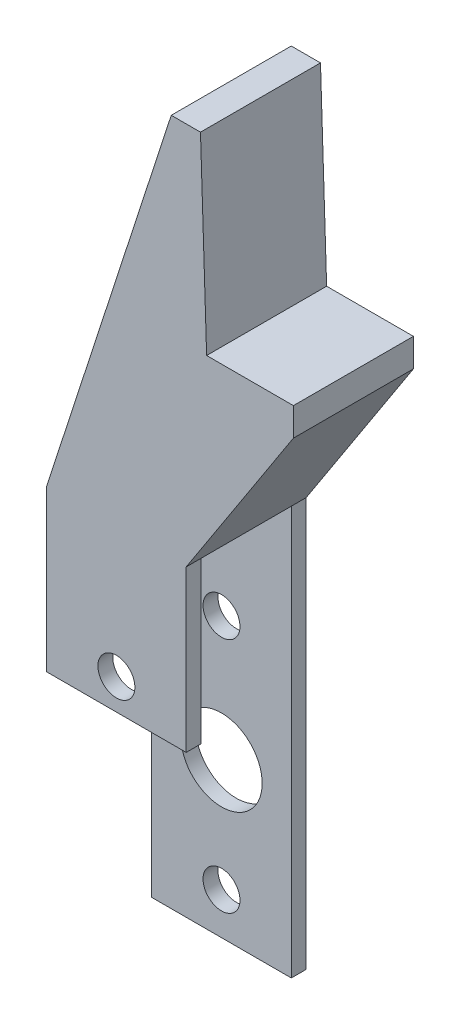
ISO-10303-21;
HEADER;
FILE_DESCRIPTION(('STEP AP214'),'2;1');
FILE_NAME('part.step','',(''),(''),'','','');
FILE_SCHEMA(('AUTOMOTIVE_DESIGN { 1 0 10303 214 1 1 1 1 }'));
ENDSEC;
DATA;
#1=APPLICATION_CONTEXT('core data for automotive mechanical design processes');
#2=APPLICATION_PROTOCOL_DEFINITION('international standard','automotive_design',2000,#1);
#3=PRODUCT_CONTEXT('',#1,'mechanical');
#4=PRODUCT('Part','Part','',(#3));
#5=PRODUCT_RELATED_PRODUCT_CATEGORY('part','',(#4));
#6=PRODUCT_DEFINITION_FORMATION('','',#4);
#7=PRODUCT_DEFINITION_CONTEXT('part definition',#1,'design');
#8=PRODUCT_DEFINITION('design','',#6,#7);
#9=PRODUCT_DEFINITION_SHAPE('','',#8);
#10=(LENGTH_UNIT() NAMED_UNIT(*) SI_UNIT(.MILLI.,.METRE.));
#11=(NAMED_UNIT(*) PLANE_ANGLE_UNIT() SI_UNIT($,.RADIAN.));
#12=(NAMED_UNIT(*) SI_UNIT($,.STERADIAN.) SOLID_ANGLE_UNIT());
#13=UNCERTAINTY_MEASURE_WITH_UNIT(LENGTH_MEASURE(1.E-05),#10,'distance_accuracy_value','');
#14=(GEOMETRIC_REPRESENTATION_CONTEXT(3) GLOBAL_UNCERTAINTY_ASSIGNED_CONTEXT((#13)) GLOBAL_UNIT_ASSIGNED_CONTEXT((#10,
#11,#12)) REPRESENTATION_CONTEXT('',''));
#15=CARTESIAN_POINT('',(0.,0.,0.));
#16=DIRECTION('',(0.,0.,1.));
#17=DIRECTION('',(1.,0.,0.));
#18=AXIS2_PLACEMENT_3D('',#15,#16,#17);
#19=CARTESIAN_POINT('',(-110.514643089675,1.26241017740988,12.2936));
#20=DIRECTION('',(1.,0.,0.));
#21=DIRECTION('',(0.,0.,-1.));
#22=AXIS2_PLACEMENT_3D('',#19,#20,#21);
#23=PLANE('',#22);
#24=DIRECTION('',(0.,0.,-1.));
#25=VECTOR('',#24,1.);
#26=CARTESIAN_POINT('',(-110.514643089675,1.26241017740988,12.2936));
#27=LINE('',#26,#25);
#28=CARTESIAN_POINT('',(-110.514643089675,1.26241017740989,1.524));
#29=VERTEX_POINT('',#28);
#30=CARTESIAN_POINT('',(-110.514643089675,1.26241017740988,0.));
#31=VERTEX_POINT('',#30);
#32=EDGE_CURVE('E11',#29,#31,#27,.T.);
#33=ORIENTED_EDGE('',*,*,#32,.F.);
#34=DIRECTION('',(0.,1.,0.));
#35=VECTOR('',#34,1.);
#36=CARTESIAN_POINT('',(-110.514643089675,0.,1.524));
#37=LINE('',#36,#35);
#38=CARTESIAN_POINT('',(-110.514643089675,43.1216101774099,1.524));
#39=VERTEX_POINT('',#38);
#40=EDGE_CURVE('E213',#29,#39,#37,.T.);
#41=ORIENTED_EDGE('',*,*,#40,.T.);
#42=DIRECTION('',(0.,0.,-1.));
#43=VECTOR('',#42,1.);
#44=CARTESIAN_POINT('',(-110.514643089675,43.1216101774099,12.2936));
#45=LINE('',#44,#43);
#46=CARTESIAN_POINT('',(-110.514643089675,43.1216101774099,0.));
#47=VERTEX_POINT('',#46);
#48=EDGE_CURVE('E95',#39,#47,#45,.T.);
#49=ORIENTED_EDGE('',*,*,#48,.T.);
#50=DIRECTION('',(0.,-1.,0.));
#51=VECTOR('',#50,1.);
#52=CARTESIAN_POINT('',(-110.514643089675,1.26241017740988,0.));
#53=LINE('',#52,#51);
#54=EDGE_CURVE('E144',#47,#31,#53,.T.);
#55=ORIENTED_EDGE('',*,*,#54,.T.);
#56=EDGE_LOOP('',(#33,#41,#49,#55));
#57=FACE_BOUND('',#56,.T.);
#58=ADVANCED_FACE('F33',(#57),#23,.F.);
#59=CARTESIAN_POINT('',(-96.2144430896747,1.26241017740988,12.2936));
#60=DIRECTION('',(-1.,0.,0.));
#61=DIRECTION('',(0.,-1.,0.));
#62=AXIS2_PLACEMENT_3D('',#59,#60,#61);
#63=PLANE('',#62);
#64=DIRECTION('',(0.,0.,-1.));
#65=VECTOR('',#64,1.);
#66=CARTESIAN_POINT('',(-96.2144430896746,43.1216101774099,12.2936));
#67=LINE('',#66,#65);
#68=CARTESIAN_POINT('',(-96.2144430896746,43.1216101774099,1.524));
#69=VERTEX_POINT('',#68);
#70=CARTESIAN_POINT('',(-96.2144430896746,43.1216101774099,0.));
#71=VERTEX_POINT('',#70);
#72=EDGE_CURVE('E176',#69,#71,#67,.T.);
#73=ORIENTED_EDGE('',*,*,#72,.F.);
#74=DIRECTION('',(0.,1.,0.));
#75=VECTOR('',#74,1.);
#76=CARTESIAN_POINT('',(-96.2144430896747,0.,1.524));
#77=LINE('',#76,#75);
#78=CARTESIAN_POINT('',(-96.2144430896747,1.26241017740988,1.524));
#79=VERTEX_POINT('',#78);
#80=EDGE_CURVE('E222',#79,#69,#77,.T.);
#81=ORIENTED_EDGE('',*,*,#80,.F.);
#82=DIRECTION('',(0.,0.,-1.));
#83=VECTOR('',#82,1.);
#84=CARTESIAN_POINT('',(-96.2144430896747,1.26241017740988,12.2936));
#85=LINE('',#84,#83);
#86=CARTESIAN_POINT('',(-96.2144430896747,1.26241017740988,0.));
#87=VERTEX_POINT('',#86);
#88=EDGE_CURVE('E42',#79,#87,#85,.T.);
#89=ORIENTED_EDGE('',*,*,#88,.T.);
#90=DIRECTION('',(0.,1.,0.));
#91=VECTOR('',#90,1.);
#92=CARTESIAN_POINT('',(-96.2144430896747,1.26241017740988,0.));
#93=LINE('',#92,#91);
#94=EDGE_CURVE('E150',#87,#71,#93,.T.);
#95=ORIENTED_EDGE('',*,*,#94,.T.);
#96=EDGE_LOOP('',(#73,#81,#89,#95));
#97=FACE_BOUND('',#96,.T.);
#98=ADVANCED_FACE('F297',(#97),#63,.F.);
#99=CARTESIAN_POINT('',(-110.514643089675,43.1216101774099,12.2936));
#100=VERTEX_POINT('',#99);
#101=CARTESIAN_POINT('',(-110.514643089675,43.1216101774099,10.7696));
#102=VERTEX_POINT('',#101);
#103=EDGE_CURVE('E165',#100,#102,#45,.T.);
#104=ORIENTED_EDGE('',*,*,#103,.T.);
#105=DIRECTION('',(0.,-1.,0.));
#106=VECTOR('',#105,1.);
#107=CARTESIAN_POINT('',(-110.514643089675,0.,10.7696));
#108=LINE('',#107,#106);
#109=CARTESIAN_POINT('',(-110.514643089675,26.6624101774099,10.7696));
#110=VERTEX_POINT('',#109);
#111=EDGE_CURVE('E206',#102,#110,#108,.T.);
#112=ORIENTED_EDGE('',*,*,#111,.T.);
#113=DIRECTION('',(0.,0.,1.));
#114=VECTOR('',#113,1.);
#115=CARTESIAN_POINT('',(-110.514643089675,26.6624101774099,0.));
#116=LINE('',#115,#114);
#117=CARTESIAN_POINT('',(-110.514643089675,26.6624101774099,12.2936));
#118=VERTEX_POINT('',#117);
#119=EDGE_CURVE('E209',#110,#118,#116,.T.);
#120=ORIENTED_EDGE('',*,*,#119,.T.);
#121=DIRECTION('',(0.,-1.,0.));
#122=VECTOR('',#121,1.);
#123=CARTESIAN_POINT('',(-110.514643089675,1.26241017740988,12.2936));
#124=LINE('',#123,#122);
#125=EDGE_CURVE('E164',#100,#118,#124,.T.);
#126=ORIENTED_EDGE('',*,*,#125,.F.);
#127=EDGE_LOOP('',(#104,#112,#120,#126));
#128=FACE_BOUND('',#127,.T.);
#129=ADVANCED_FACE('F35',(#128),#23,.F.);
#130=CARTESIAN_POINT('',(-110.514643089675,1.26241017740988,12.2936));
#131=DIRECTION('',(0.,1.,0.));
#132=DIRECTION('',(0.,0.,1.));
#133=AXIS2_PLACEMENT_3D('',#130,#131,#132);
#134=PLANE('',#133);
#135=ORIENTED_EDGE('',*,*,#88,.F.);
#136=DIRECTION('',(1.,0.,0.));
#137=VECTOR('',#136,1.);
#138=CARTESIAN_POINT('',(-110.514643089675,1.26241017740989,1.524));
#139=LINE('',#138,#137);
#140=EDGE_CURVE('E232',#29,#79,#139,.T.);
#141=ORIENTED_EDGE('',*,*,#140,.F.);
#142=ORIENTED_EDGE('',*,*,#32,.T.);
#143=DIRECTION('',(1.,0.,0.));
#144=VECTOR('',#143,1.);
#145=CARTESIAN_POINT('',(-110.514643089675,1.26241017740988,0.));
#146=LINE('',#145,#144);
#147=EDGE_CURVE('E146',#31,#87,#146,.T.);
#148=ORIENTED_EDGE('',*,*,#147,.T.);
#149=EDGE_LOOP('',(#135,#141,#142,#148));
#150=FACE_BOUND('',#149,.T.);
#151=ADVANCED_FACE('F302',(#150),#134,.F.);
#152=DIRECTION('',(0.,0.,1.));
#153=VECTOR('',#152,1.);
#154=CARTESIAN_POINT('',(-96.2144430896746,26.6624101774099,0.));
#155=LINE('',#154,#153);
#156=CARTESIAN_POINT('',(-96.2144430896746,26.6624101774099,10.7696));
#157=VERTEX_POINT('',#156);
#158=CARTESIAN_POINT('',(-96.2144430896746,26.6624101774099,12.2936));
#159=VERTEX_POINT('',#158);
#160=EDGE_CURVE('E50',#157,#159,#155,.T.);
#161=ORIENTED_EDGE('',*,*,#160,.F.);
#162=DIRECTION('',(0.,-1.,0.));
#163=VECTOR('',#162,1.);
#164=CARTESIAN_POINT('',(-96.2144430896747,0.,10.7696));
#165=LINE('',#164,#163);
#166=CARTESIAN_POINT('',(-96.2144430896746,43.1216101774099,10.7696));
#167=VERTEX_POINT('',#166);
#168=EDGE_CURVE('E183',#167,#157,#165,.T.);
#169=ORIENTED_EDGE('',*,*,#168,.F.);
#170=CARTESIAN_POINT('',(-96.2144430896746,43.1216101774099,12.2936));
#171=VERTEX_POINT('',#170);
#172=EDGE_CURVE('E177',#171,#167,#67,.T.);
#173=ORIENTED_EDGE('',*,*,#172,.F.);
#174=DIRECTION('',(0.,1.,0.));
#175=VECTOR('',#174,1.);
#176=CARTESIAN_POINT('',(-96.2144430896747,1.26241017740988,12.2936));
#177=LINE('',#176,#175);
#178=EDGE_CURVE('E102',#159,#171,#177,.T.);
#179=ORIENTED_EDGE('',*,*,#178,.F.);
#180=EDGE_LOOP('',(#161,#169,#173,#179));
#181=FACE_BOUND('',#180,.T.);
#182=ADVANCED_FACE('F290',(#181),#63,.F.);
#183=CARTESIAN_POINT('',(-96.2144430896746,43.1216101774099,12.2936));
#184=DIRECTION('',(-0.838670567945426,0.544639035015025,0.));
#185=DIRECTION('',(-0.544639035015025,-0.838670567945426,0.));
#186=AXIS2_PLACEMENT_3D('',#183,#184,#185);
#187=PLANE('',#186);
#188=DIRECTION('',(0.544639035015025,0.838670567945426,0.));
#189=VECTOR('',#188,1.);
#190=CARTESIAN_POINT('',(-96.2144430896746,43.1216101774099,0.));
#191=LINE('',#190,#189);
#192=CARTESIAN_POINT('',(-85.2303808871056,60.0355827235061,0.));
#193=VERTEX_POINT('',#192);
#194=EDGE_CURVE('E153',#71,#193,#191,.T.);
#195=ORIENTED_EDGE('',*,*,#194,.T.);
#196=DIRECTION('',(0.,0.,-1.));
#197=VECTOR('',#196,1.);
#198=CARTESIAN_POINT('',(-85.2303808871056,60.0355827235061,12.2936));
#199=LINE('',#198,#197);
#200=CARTESIAN_POINT('',(-85.2303808871056,60.0355827235061,12.2936));
#201=VERTEX_POINT('',#200);
#202=EDGE_CURVE('E173',#201,#193,#199,.T.);
#203=ORIENTED_EDGE('',*,*,#202,.F.);
#204=DIRECTION('',(0.544639035015025,0.838670567945426,0.));
#205=VECTOR('',#204,1.);
#206=CARTESIAN_POINT('',(-96.2144430896746,43.1216101774099,12.2936));
#207=LINE('',#206,#205);
#208=EDGE_CURVE('E240',#171,#201,#207,.T.);
#209=ORIENTED_EDGE('',*,*,#208,.F.);
#210=ORIENTED_EDGE('',*,*,#172,.T.);
#211=DIRECTION('',(0.,0.,1.));
#212=VECTOR('',#211,1.);
#213=CARTESIAN_POINT('',(-96.2144430896746,43.1216101774099,0.));
#214=LINE('',#213,#212);
#215=EDGE_CURVE('E210',#69,#167,#214,.T.);
#216=ORIENTED_EDGE('',*,*,#215,.F.);
#217=ORIENTED_EDGE('',*,*,#72,.T.);
#218=EDGE_LOOP('',(#195,#203,#209,#210,#216,#217));
#219=FACE_BOUND('',#218,.T.);
#220=ADVANCED_FACE('F291',(#219),#187,.F.);
#221=CARTESIAN_POINT('',(-85.2303808871056,62.9240263733276,12.2936));
#222=DIRECTION('',(-1.,0.,0.));
#223=DIRECTION('',(0.,0.,1.));
#224=AXIS2_PLACEMENT_3D('',#221,#222,#223);
#225=PLANE('',#224);
#226=DIRECTION('',(0.,1.,0.));
#227=VECTOR('',#226,1.);
#228=CARTESIAN_POINT('',(-85.2303808871056,62.9240263733276,0.));
#229=LINE('',#228,#227);
#230=CARTESIAN_POINT('',(-85.2303808871056,62.9240263733276,0.));
#231=VERTEX_POINT('',#230);
#232=EDGE_CURVE('E155',#193,#231,#229,.T.);
#233=ORIENTED_EDGE('',*,*,#232,.T.);
#234=DIRECTION('',(0.,0.,-1.));
#235=VECTOR('',#234,1.);
#236=CARTESIAN_POINT('',(-85.2303808871056,62.9240263733276,12.2936));
#237=LINE('',#236,#235);
#238=CARTESIAN_POINT('',(-85.2303808871056,62.9240263733276,12.2936));
#239=VERTEX_POINT('',#238);
#240=EDGE_CURVE('E170',#239,#231,#237,.T.);
#241=ORIENTED_EDGE('',*,*,#240,.F.);
#242=DIRECTION('',(0.,1.,0.));
#243=VECTOR('',#242,1.);
#244=CARTESIAN_POINT('',(-85.2303808871056,62.9240263733276,12.2936));
#245=LINE('',#244,#243);
#246=EDGE_CURVE('E242',#201,#239,#245,.T.);
#247=ORIENTED_EDGE('',*,*,#246,.F.);
#248=ORIENTED_EDGE('',*,*,#202,.T.);
#249=EDGE_LOOP('',(#233,#241,#247,#248));
#250=FACE_BOUND('',#249,.T.);
#251=ADVANCED_FACE('F248',(#250),#225,.F.);
#252=CARTESIAN_POINT('',(-94.1200963562197,62.9240263733276,12.2936));
#253=DIRECTION('',(0.,-1.,0.));
#254=DIRECTION('',(0.,0.,-1.));
#255=AXIS2_PLACEMENT_3D('',#252,#253,#254);
#256=PLANE('',#255);
#257=DIRECTION('',(-1.,0.,0.));
#258=VECTOR('',#257,1.);
#259=CARTESIAN_POINT('',(-94.1200963562197,62.9240263733276,0.));
#260=LINE('',#259,#258);
#261=CARTESIAN_POINT('',(-94.1200963562197,62.9240263733276,0.));
#262=VERTEX_POINT('',#261);
#263=EDGE_CURVE('E157',#231,#262,#260,.T.);
#264=ORIENTED_EDGE('',*,*,#263,.T.);
#265=DIRECTION('',(0.,0.,-1.));
#266=VECTOR('',#265,1.);
#267=CARTESIAN_POINT('',(-94.1200963562197,62.9240263733276,12.2936));
#268=LINE('',#267,#266);
#269=CARTESIAN_POINT('',(-94.1200963562197,62.9240263733276,12.2936));
#270=VERTEX_POINT('',#269);
#271=EDGE_CURVE('E135',#270,#262,#268,.T.);
#272=ORIENTED_EDGE('',*,*,#271,.F.);
#273=DIRECTION('',(-1.,0.,0.));
#274=VECTOR('',#273,1.);
#275=CARTESIAN_POINT('',(-94.1200963562197,62.9240263733276,12.2936));
#276=LINE('',#275,#274);
#277=EDGE_CURVE('E123',#239,#270,#276,.T.);
#278=ORIENTED_EDGE('',*,*,#277,.F.);
#279=ORIENTED_EDGE('',*,*,#240,.T.);
#280=EDGE_LOOP('',(#264,#272,#278,#279));
#281=FACE_BOUND('',#280,.T.);
#282=ADVANCED_FACE('F252',(#281),#256,.F.);
#283=CARTESIAN_POINT('',(-94.1200963562197,62.9240263733276,12.2936));
#284=DIRECTION('',(-0.999478768727025,-0.0322829810257777,0.));
#285=DIRECTION('',(0.0322829810257777,-0.999478768727025,0.));
#286=AXIS2_PLACEMENT_3D('',#283,#284,#285);
#287=PLANE('',#286);
#288=DIRECTION('',(-0.0322829810257777,0.999478768727025,0.));
#289=VECTOR('',#288,1.);
#290=CARTESIAN_POINT('',(-94.1200963562197,62.9240263733276,0.));
#291=LINE('',#290,#289);
#292=CARTESIAN_POINT('',(-94.7499671742199,82.4247815585202,0.));
#293=VERTEX_POINT('',#292);
#294=EDGE_CURVE('E132',#262,#293,#291,.T.);
#295=ORIENTED_EDGE('',*,*,#294,.T.);
#296=DIRECTION('',(0.,0.,-1.));
#297=VECTOR('',#296,1.);
#298=CARTESIAN_POINT('',(-94.7499671742199,82.4247815585202,12.2936));
#299=LINE('',#298,#297);
#300=CARTESIAN_POINT('',(-94.7499671742199,82.4247815585202,12.2936));
#301=VERTEX_POINT('',#300);
#302=EDGE_CURVE('E129',#301,#293,#299,.T.);
#303=ORIENTED_EDGE('',*,*,#302,.F.);
#304=DIRECTION('',(-0.0322829810257777,0.999478768727025,0.));
#305=VECTOR('',#304,1.);
#306=CARTESIAN_POINT('',(-94.1200963562197,62.9240263733276,12.2936));
#307=LINE('',#306,#305);
#308=EDGE_CURVE('E116',#270,#301,#307,.T.);
#309=ORIENTED_EDGE('',*,*,#308,.F.);
#310=ORIENTED_EDGE('',*,*,#271,.T.);
#311=EDGE_LOOP('',(#295,#303,#309,#310));
#312=FACE_BOUND('',#311,.T.);
#313=ADVANCED_FACE('F130',(#312),#287,.F.);
#314=CARTESIAN_POINT('',(-94.7499671742199,82.4247815585202,12.2936));
#315=DIRECTION('',(0.,-1.,0.));
#316=DIRECTION('',(0.,0.,-1.));
#317=AXIS2_PLACEMENT_3D('',#314,#315,#316);
#318=PLANE('',#317);
#319=DIRECTION('',(-1.,0.,0.));
#320=VECTOR('',#319,1.);
#321=CARTESIAN_POINT('',(-94.7499671742199,82.4247815585202,0.));
#322=LINE('',#321,#320);
#323=CARTESIAN_POINT('',(-97.7442685835346,82.4247815585202,0.));
#324=VERTEX_POINT('',#323);
#325=EDGE_CURVE('E160',#293,#324,#322,.T.);
#326=ORIENTED_EDGE('',*,*,#325,.T.);
#327=DIRECTION('',(0.,0.,-1.));
#328=VECTOR('',#327,1.);
#329=CARTESIAN_POINT('',(-97.7442685835346,82.4247815585202,12.2936));
#330=LINE('',#329,#328);
#331=CARTESIAN_POINT('',(-97.7442685835346,82.4247815585202,12.2936));
#332=VERTEX_POINT('',#331);
#333=EDGE_CURVE('E136',#332,#324,#330,.T.);
#334=ORIENTED_EDGE('',*,*,#333,.F.);
#335=DIRECTION('',(-1.,0.,0.));
#336=VECTOR('',#335,1.);
#337=CARTESIAN_POINT('',(-94.7499671742199,82.4247815585202,12.2936));
#338=LINE('',#337,#336);
#339=EDGE_CURVE('E120',#301,#332,#338,.T.);
#340=ORIENTED_EDGE('',*,*,#339,.F.);
#341=ORIENTED_EDGE('',*,*,#302,.T.);
#342=EDGE_LOOP('',(#326,#334,#340,#341));
#343=FACE_BOUND('',#342,.T.);
#344=ADVANCED_FACE('F138',(#343),#318,.F.);
#345=CARTESIAN_POINT('',(-110.514643089675,43.1216101774099,12.2936));
#346=DIRECTION('',(0.951056516295154,-0.309016994374945,0.));
#347=DIRECTION('',(0.309016994374945,0.951056516295155,0.));
#348=AXIS2_PLACEMENT_3D('',#345,#346,#347);
#349=PLANE('',#348);
#350=DIRECTION('',(-0.309016994374945,-0.951056516295154,0.));
#351=VECTOR('',#350,1.);
#352=CARTESIAN_POINT('',(-110.514643089675,43.1216101774099,0.));
#353=LINE('',#352,#351);
#354=EDGE_CURVE('E162',#324,#47,#353,.T.);
#355=ORIENTED_EDGE('',*,*,#354,.T.);
#356=ORIENTED_EDGE('',*,*,#48,.F.);
#357=DIRECTION('',(0.,0.,1.));
#358=VECTOR('',#357,1.);
#359=CARTESIAN_POINT('',(-110.514643089675,43.1216101774099,0.));
#360=LINE('',#359,#358);
#361=EDGE_CURVE('E215',#39,#102,#360,.T.);
#362=ORIENTED_EDGE('',*,*,#361,.T.);
#363=ORIENTED_EDGE('',*,*,#103,.F.);
#364=DIRECTION('',(-0.309016994374945,-0.951056516295154,0.));
#365=VECTOR('',#364,1.);
#366=CARTESIAN_POINT('',(-110.514643089675,43.1216101774099,12.2936));
#367=LINE('',#366,#365);
#368=EDGE_CURVE('E59',#332,#100,#367,.T.);
#369=ORIENTED_EDGE('',*,*,#368,.F.);
#370=ORIENTED_EDGE('',*,*,#333,.T.);
#371=EDGE_LOOP('',(#355,#356,#362,#363,#369,#370));
#372=FACE_BOUND('',#371,.T.);
#373=ADVANCED_FACE('F258',(#372),#349,.F.);
#374=CARTESIAN_POINT('',(0.,0.,12.2936));
#375=DIRECTION('',(0.,0.,1.));
#376=DIRECTION('',(1.,0.,0.));
#377=AXIS2_PLACEMENT_3D('',#374,#375,#376);
#378=PLANE('',#377);
#379=CARTESIAN_POINT('',(-103.364543089675,29.8120101774099,12.2936));
#380=DIRECTION('',(0.,0.,1.));
#381=DIRECTION('',(1.,0.,0.));
#382=AXIS2_PLACEMENT_3D('',#379,#380,#381);
#383=CIRCLE('',#382,1.89230000000001);
#384=CARTESIAN_POINT('',(-101.472243089675,29.8120101774099,12.2936));
#385=VERTEX_POINT('',#384);
#386=EDGE_CURVE('E192',#385,#385,#383,.T.);
#387=ORIENTED_EDGE('',*,*,#386,.F.);
#388=EDGE_LOOP('',(#387));
#389=FACE_BOUND('',#388,.T.);
#390=DIRECTION('',(1.,0.,0.));
#391=VECTOR('',#390,1.);
#392=CARTESIAN_POINT('',(-110.514643089675,26.6624101774099,12.2936));
#393=LINE('',#392,#391);
#394=EDGE_CURVE('E235',#118,#159,#393,.T.);
#395=ORIENTED_EDGE('',*,*,#394,.T.);
#396=ORIENTED_EDGE('',*,*,#178,.T.);
#397=ORIENTED_EDGE('',*,*,#208,.T.);
#398=ORIENTED_EDGE('',*,*,#246,.T.);
#399=ORIENTED_EDGE('',*,*,#277,.T.);
#400=ORIENTED_EDGE('',*,*,#308,.T.);
#401=ORIENTED_EDGE('',*,*,#339,.T.);
#402=ORIENTED_EDGE('',*,*,#368,.T.);
#403=ORIENTED_EDGE('',*,*,#125,.T.);
#404=EDGE_LOOP('',(#395,#396,#397,#398,#399,#400,#401,#402,#403));
#405=FACE_BOUND('',#404,.T.);
#406=ADVANCED_FACE('F118',(#389,#405),#378,.T.);
#407=CARTESIAN_POINT('',(0.,0.,0.));
#408=DIRECTION('',(0.,0.,1.));
#409=DIRECTION('',(1.,0.,0.));
#410=AXIS2_PLACEMENT_3D('',#407,#408,#409);
#411=PLANE('',#410);
#412=CARTESIAN_POINT('',(-103.364543089675,17.0358101774099,0.));
#413=DIRECTION('',(0.,0.,-1.));
#414=DIRECTION('',(-1.,0.,0.));
#415=AXIS2_PLACEMENT_3D('',#412,#413,#414);
#416=CIRCLE('',#415,4.16814);
#417=CARTESIAN_POINT('',(-107.532683089675,17.0358101774099,0.));
#418=VERTEX_POINT('',#417);
#419=EDGE_CURVE('E199',#418,#418,#416,.T.);
#420=ORIENTED_EDGE('',*,*,#419,.F.);
#421=EDGE_LOOP('',(#420));
#422=FACE_BOUND('',#421,.T.);
#423=CARTESIAN_POINT('',(-103.364543089675,29.8120101774099,0.));
#424=DIRECTION('',(0.,0.,-1.));
#425=DIRECTION('',(-1.,0.,0.));
#426=AXIS2_PLACEMENT_3D('',#423,#424,#425);
#427=CIRCLE('',#426,1.89230000000001);
#428=CARTESIAN_POINT('',(-105.256843089675,29.8120101774099,0.));
#429=VERTEX_POINT('',#428);
#430=EDGE_CURVE('E188',#429,#429,#427,.T.);
#431=ORIENTED_EDGE('',*,*,#430,.F.);
#432=EDGE_LOOP('',(#431));
#433=FACE_BOUND('',#432,.T.);
#434=CARTESIAN_POINT('',(-103.364543089675,5.52961017740989,0.));
#435=DIRECTION('',(0.,0.,-1.));
#436=DIRECTION('',(-1.,0.,0.));
#437=AXIS2_PLACEMENT_3D('',#434,#435,#436);
#438=CIRCLE('',#437,1.89230000000001);
#439=CARTESIAN_POINT('',(-105.256843089675,5.52961017740989,0.));
#440=VERTEX_POINT('',#439);
#441=EDGE_CURVE('E184',#440,#440,#438,.T.);
#442=ORIENTED_EDGE('',*,*,#441,.F.);
#443=EDGE_LOOP('',(#442));
#444=FACE_BOUND('',#443,.T.);
#445=ORIENTED_EDGE('',*,*,#54,.F.);
#446=ORIENTED_EDGE('',*,*,#354,.F.);
#447=ORIENTED_EDGE('',*,*,#325,.F.);
#448=ORIENTED_EDGE('',*,*,#294,.F.);
#449=ORIENTED_EDGE('',*,*,#263,.F.);
#450=ORIENTED_EDGE('',*,*,#232,.F.);
#451=ORIENTED_EDGE('',*,*,#194,.F.);
#452=ORIENTED_EDGE('',*,*,#94,.F.);
#453=ORIENTED_EDGE('',*,*,#147,.F.);
#454=EDGE_LOOP('',(#445,#446,#447,#448,#449,#450,#451,#452,#453));
#455=FACE_BOUND('',#454,.T.);
#456=ADVANCED_FACE('F255',(#422,#433,#444,#455),#411,.F.);
#457=CARTESIAN_POINT('',(-110.514643089675,0.,10.7696));
#458=DIRECTION('',(0.,0.,1.));
#459=DIRECTION('',(0.,-1.,0.));
#460=AXIS2_PLACEMENT_3D('',#457,#458,#459);
#461=PLANE('',#460);
#462=CARTESIAN_POINT('',(-103.364543089675,29.8120101774099,10.7696));
#463=DIRECTION('',(0.,0.,1.));
#464=DIRECTION('',(0.,-1.,0.));
#465=AXIS2_PLACEMENT_3D('',#462,#463,#464);
#466=CIRCLE('',#465,1.89230000000001);
#467=CARTESIAN_POINT('',(-103.364543089675,27.9197101774099,10.7696));
#468=VERTEX_POINT('',#467);
#469=EDGE_CURVE('E187',#468,#468,#466,.T.);
#470=ORIENTED_EDGE('',*,*,#469,.T.);
#471=EDGE_LOOP('',(#470));
#472=FACE_BOUND('',#471,.T.);
#473=ORIENTED_EDGE('',*,*,#168,.T.);
#474=DIRECTION('',(1.,0.,0.));
#475=VECTOR('',#474,1.);
#476=CARTESIAN_POINT('',(-110.514643089675,26.6624101774099,10.7696));
#477=LINE('',#476,#475);
#478=EDGE_CURVE('E218',#110,#157,#477,.T.);
#479=ORIENTED_EDGE('',*,*,#478,.F.);
#480=ORIENTED_EDGE('',*,*,#111,.F.);
#481=DIRECTION('',(1.,0.,0.));
#482=VECTOR('',#481,1.);
#483=CARTESIAN_POINT('',(-110.514643089675,43.1216101774099,10.7696));
#484=LINE('',#483,#482);
#485=EDGE_CURVE('E147',#102,#167,#484,.T.);
#486=ORIENTED_EDGE('',*,*,#485,.T.);
#487=EDGE_LOOP('',(#473,#479,#480,#486));
#488=FACE_BOUND('',#487,.T.);
#489=ADVANCED_FACE('F284',(#472,#488),#461,.F.);
#490=CARTESIAN_POINT('',(-110.514643089675,43.1216101774099,0.));
#491=DIRECTION('',(0.,1.,0.));
#492=DIRECTION('',(-1.,0.,0.));
#493=AXIS2_PLACEMENT_3D('',#490,#491,#492);
#494=PLANE('',#493);
#495=ORIENTED_EDGE('',*,*,#215,.T.);
#496=ORIENTED_EDGE('',*,*,#485,.F.);
#497=ORIENTED_EDGE('',*,*,#361,.F.);
#498=DIRECTION('',(1.,0.,0.));
#499=VECTOR('',#498,1.);
#500=CARTESIAN_POINT('',(-110.514643089675,43.1216101774099,1.524));
#501=LINE('',#500,#499);
#502=EDGE_CURVE('E229',#39,#69,#501,.T.);
#503=ORIENTED_EDGE('',*,*,#502,.T.);
#504=EDGE_LOOP('',(#495,#496,#497,#503));
#505=FACE_BOUND('',#504,.T.);
#506=ADVANCED_FACE('F287',(#505),#494,.F.);
#507=CARTESIAN_POINT('',(-110.514643089675,0.,1.524));
#508=DIRECTION('',(0.,0.,-1.));
#509=DIRECTION('',(-1.,0.,0.));
#510=AXIS2_PLACEMENT_3D('',#507,#508,#509);
#511=PLANE('',#510);
#512=CARTESIAN_POINT('',(-103.364543089675,17.0358101774099,1.524));
#513=DIRECTION('',(0.,0.,-1.));
#514=DIRECTION('',(-1.,0.,0.));
#515=AXIS2_PLACEMENT_3D('',#512,#513,#514);
#516=CIRCLE('',#515,4.16814);
#517=CARTESIAN_POINT('',(-107.532683089675,17.0358101774099,1.524));
#518=VERTEX_POINT('',#517);
#519=EDGE_CURVE('E37',#518,#518,#516,.T.);
#520=ORIENTED_EDGE('',*,*,#519,.T.);
#521=EDGE_LOOP('',(#520));
#522=FACE_BOUND('',#521,.T.);
#523=CARTESIAN_POINT('',(-103.364543089675,29.8120101774099,1.524));
#524=DIRECTION('',(0.,0.,-1.));
#525=DIRECTION('',(-1.,0.,0.));
#526=AXIS2_PLACEMENT_3D('',#523,#524,#525);
#527=CIRCLE('',#526,1.89230000000001);
#528=CARTESIAN_POINT('',(-105.256843089675,29.8120101774099,1.524));
#529=VERTEX_POINT('',#528);
#530=EDGE_CURVE('E185',#529,#529,#527,.T.);
#531=ORIENTED_EDGE('',*,*,#530,.T.);
#532=EDGE_LOOP('',(#531));
#533=FACE_BOUND('',#532,.T.);
#534=CARTESIAN_POINT('',(-103.364543089675,5.52961017740989,1.524));
#535=DIRECTION('',(0.,0.,-1.));
#536=DIRECTION('',(-1.,0.,0.));
#537=AXIS2_PLACEMENT_3D('',#534,#535,#536);
#538=CIRCLE('',#537,1.89230000000001);
#539=CARTESIAN_POINT('',(-105.256843089675,5.52961017740989,1.524));
#540=VERTEX_POINT('',#539);
#541=EDGE_CURVE('E181',#540,#540,#538,.T.);
#542=ORIENTED_EDGE('',*,*,#541,.T.);
#543=EDGE_LOOP('',(#542));
#544=FACE_BOUND('',#543,.T.);
#545=ORIENTED_EDGE('',*,*,#80,.T.);
#546=ORIENTED_EDGE('',*,*,#502,.F.);
#547=ORIENTED_EDGE('',*,*,#40,.F.);
#548=ORIENTED_EDGE('',*,*,#140,.T.);
#549=EDGE_LOOP('',(#545,#546,#547,#548));
#550=FACE_BOUND('',#549,.T.);
#551=ADVANCED_FACE('F305',(#522,#533,#544,#550),#511,.F.);
#552=CARTESIAN_POINT('',(-110.514643089675,26.6624101774099,0.));
#553=DIRECTION('',(0.,1.,0.));
#554=DIRECTION('',(-1.,0.,0.));
#555=AXIS2_PLACEMENT_3D('',#552,#553,#554);
#556=PLANE('',#555);
#557=ORIENTED_EDGE('',*,*,#160,.T.);
#558=ORIENTED_EDGE('',*,*,#394,.F.);
#559=ORIENTED_EDGE('',*,*,#119,.F.);
#560=ORIENTED_EDGE('',*,*,#478,.T.);
#561=EDGE_LOOP('',(#557,#558,#559,#560));
#562=FACE_BOUND('',#561,.T.);
#563=ADVANCED_FACE('F307',(#562),#556,.F.);
#564=CARTESIAN_POINT('',(-103.364543089675,5.52961017740989,14.3002));
#565=DIRECTION('',(0.,0.,-1.));
#566=DIRECTION('',(-1.,0.,0.));
#567=AXIS2_PLACEMENT_3D('',#564,#565,#566);
#568=CYLINDRICAL_SURFACE('',#567,1.89230000000001);
#569=ORIENTED_EDGE('',*,*,#441,.T.);
#570=EDGE_LOOP('',(#569));
#571=FACE_BOUND('',#570,.T.);
#572=ORIENTED_EDGE('',*,*,#541,.F.);
#573=EDGE_LOOP('',(#572));
#574=FACE_BOUND('',#573,.T.);
#575=ADVANCED_FACE('F315',(#571,#574),#568,.F.);
#576=CARTESIAN_POINT('',(-103.364543089675,29.8120101774099,14.3002));
#577=DIRECTION('',(0.,0.,-1.));
#578=DIRECTION('',(-1.,0.,0.));
#579=AXIS2_PLACEMENT_3D('',#576,#577,#578);
#580=CYLINDRICAL_SURFACE('',#579,1.89230000000001);
#581=ORIENTED_EDGE('',*,*,#430,.T.);
#582=EDGE_LOOP('',(#581));
#583=FACE_BOUND('',#582,.T.);
#584=ORIENTED_EDGE('',*,*,#530,.F.);
#585=EDGE_LOOP('',(#584));
#586=FACE_BOUND('',#585,.T.);
#587=ADVANCED_FACE('F358',(#583,#586),#580,.F.);
#588=ORIENTED_EDGE('',*,*,#386,.T.);
#589=EDGE_LOOP('',(#588));
#590=FACE_BOUND('',#589,.T.);
#591=ORIENTED_EDGE('',*,*,#469,.F.);
#592=EDGE_LOOP('',(#591));
#593=FACE_BOUND('',#592,.T.);
#594=ADVANCED_FACE('F355',(#590,#593),#580,.F.);
#595=CARTESIAN_POINT('',(-103.364543089675,17.0358101774099,14.3002));
#596=DIRECTION('',(0.,0.,-1.));
#597=DIRECTION('',(-1.,0.,0.));
#598=AXIS2_PLACEMENT_3D('',#595,#596,#597);
#599=CYLINDRICAL_SURFACE('',#598,4.16814);
#600=ORIENTED_EDGE('',*,*,#419,.T.);
#601=EDGE_LOOP('',(#600));
#602=FACE_BOUND('',#601,.T.);
#603=ORIENTED_EDGE('',*,*,#519,.F.);
#604=EDGE_LOOP('',(#603));
#605=FACE_BOUND('',#604,.T.);
#606=ADVANCED_FACE('F357',(#602,#605),#599,.F.);
#607=CLOSED_SHELL('',(#58,#98,#129,#151,#182,#220,#251,#282,#313,#344,#373,#406,#456,#489,#506,
#551,#563,#575,#587,#594,#606));
#608=MANIFOLD_SOLID_BREP('B2',#607);
#609=ADVANCED_BREP_SHAPE_REPRESENTATION('',(#18,#608),#14);
#610=SHAPE_DEFINITION_REPRESENTATION(#9,#609);
ENDSEC;
END-ISO-10303-21;
